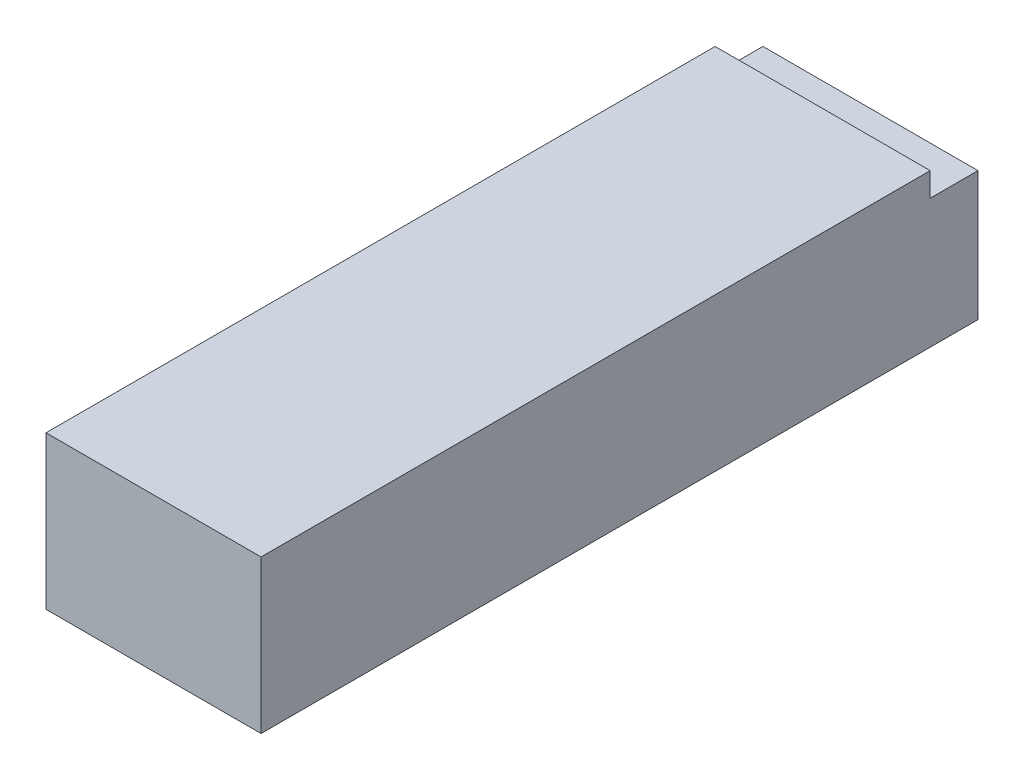
ISO-10303-21;
HEADER;
FILE_DESCRIPTION(('STEP AP214'),'2;1');
FILE_NAME('part.step','',(''),(''),'','','');
FILE_SCHEMA(('AUTOMOTIVE_DESIGN { 1 0 10303 214 1 1 1 1 }'));
ENDSEC;
DATA;
#1=APPLICATION_CONTEXT('core data for automotive mechanical design processes');
#2=APPLICATION_PROTOCOL_DEFINITION('international standard','automotive_design',2000,#1);
#3=PRODUCT_CONTEXT('',#1,'mechanical');
#4=PRODUCT('Part','Part','',(#3));
#5=PRODUCT_RELATED_PRODUCT_CATEGORY('part','',(#4));
#6=PRODUCT_DEFINITION_FORMATION('','',#4);
#7=PRODUCT_DEFINITION_CONTEXT('part definition',#1,'design');
#8=PRODUCT_DEFINITION('design','',#6,#7);
#9=PRODUCT_DEFINITION_SHAPE('','',#8);
#10=(LENGTH_UNIT() NAMED_UNIT(*) SI_UNIT(.MILLI.,.METRE.));
#11=(NAMED_UNIT(*) PLANE_ANGLE_UNIT() SI_UNIT($,.RADIAN.));
#12=(NAMED_UNIT(*) SI_UNIT($,.STERADIAN.) SOLID_ANGLE_UNIT());
#13=UNCERTAINTY_MEASURE_WITH_UNIT(LENGTH_MEASURE(1.E-05),#10,'distance_accuracy_value','');
#14=(GEOMETRIC_REPRESENTATION_CONTEXT(3) GLOBAL_UNCERTAINTY_ASSIGNED_CONTEXT((#13)) GLOBAL_UNIT_ASSIGNED_CONTEXT((#10,
#11,#12)) REPRESENTATION_CONTEXT('',''));
#15=CARTESIAN_POINT('',(0.,0.,0.));
#16=DIRECTION('',(0.,0.,1.));
#17=DIRECTION('',(1.,0.,0.));
#18=AXIS2_PLACEMENT_3D('',#15,#16,#17);
#19=CARTESIAN_POINT('',(22.5,16.,150.));
#20=DIRECTION('',(-1.,0.,0.));
#21=DIRECTION('',(0.,-1.,0.));
#22=AXIS2_PLACEMENT_3D('',#19,#20,#21);
#23=PLANE('',#22);
#24=DIRECTION('',(0.,0.,-1.));
#25=VECTOR('',#24,1.);
#26=CARTESIAN_POINT('',(22.5,11.,10.));
#27=LINE('',#26,#25);
#28=CARTESIAN_POINT('',(22.5,11.,10.));
#29=VERTEX_POINT('',#28);
#30=CARTESIAN_POINT('',(22.5,11.,0.));
#31=VERTEX_POINT('',#30);
#32=EDGE_CURVE('E57',#29,#31,#27,.T.);
#33=ORIENTED_EDGE('',*,*,#32,.F.);
#34=DIRECTION('',(0.,1.,0.));
#35=VECTOR('',#34,1.);
#36=CARTESIAN_POINT('',(22.5,11.,10.));
#37=LINE('',#36,#35);
#38=CARTESIAN_POINT('',(22.5,16.,10.));
#39=VERTEX_POINT('',#38);
#40=EDGE_CURVE('E126',#29,#39,#37,.T.);
#41=ORIENTED_EDGE('',*,*,#40,.T.);
#42=DIRECTION('',(0.,0.,-1.));
#43=VECTOR('',#42,1.);
#44=CARTESIAN_POINT('',(22.5,16.,150.));
#45=LINE('',#44,#43);
#46=CARTESIAN_POINT('',(22.5,16.,150.));
#47=VERTEX_POINT('',#46);
#48=EDGE_CURVE('E11',#47,#39,#45,.T.);
#49=ORIENTED_EDGE('',*,*,#48,.F.);
#50=DIRECTION('',(0.,1.,0.));
#51=VECTOR('',#50,1.);
#52=CARTESIAN_POINT('',(22.5,16.,150.));
#53=LINE('',#52,#51);
#54=CARTESIAN_POINT('',(22.5,-16.,150.));
#55=VERTEX_POINT('',#54);
#56=EDGE_CURVE('E124',#55,#47,#53,.T.);
#57=ORIENTED_EDGE('',*,*,#56,.F.);
#58=DIRECTION('',(0.,0.,-1.));
#59=VECTOR('',#58,1.);
#60=CARTESIAN_POINT('',(22.5,-16.,150.));
#61=LINE('',#60,#59);
#62=CARTESIAN_POINT('',(22.5,-16.,0.));
#63=VERTEX_POINT('',#62);
#64=EDGE_CURVE('E130',#55,#63,#61,.T.);
#65=ORIENTED_EDGE('',*,*,#64,.T.);
#66=DIRECTION('',(0.,1.,0.));
#67=VECTOR('',#66,1.);
#68=CARTESIAN_POINT('',(22.5,16.,0.));
#69=LINE('',#68,#67);
#70=EDGE_CURVE('E122',#63,#31,#69,.T.);
#71=ORIENTED_EDGE('',*,*,#70,.T.);
#72=EDGE_LOOP('',(#33,#41,#49,#57,#65,#71));
#73=FACE_BOUND('',#72,.T.);
#74=ADVANCED_FACE('F43',(#73),#23,.F.);
#75=CARTESIAN_POINT('',(-22.5,16.,150.));
#76=DIRECTION('',(0.,-1.,0.));
#77=DIRECTION('',(0.,0.,-1.));
#78=AXIS2_PLACEMENT_3D('',#75,#76,#77);
#79=PLANE('',#78);
#80=ORIENTED_EDGE('',*,*,#48,.T.);
#81=DIRECTION('',(1.,0.,0.));
#82=VECTOR('',#81,1.);
#83=CARTESIAN_POINT('',(-22.5,16.,10.));
#84=LINE('',#83,#82);
#85=CARTESIAN_POINT('',(-22.5,16.,10.));
#86=VERTEX_POINT('',#85);
#87=EDGE_CURVE('E137',#86,#39,#84,.T.);
#88=ORIENTED_EDGE('',*,*,#87,.F.);
#89=DIRECTION('',(0.,0.,-1.));
#90=VECTOR('',#89,1.);
#91=CARTESIAN_POINT('',(-22.5,16.,150.));
#92=LINE('',#91,#90);
#93=CARTESIAN_POINT('',(-22.5,16.,150.));
#94=VERTEX_POINT('',#93);
#95=EDGE_CURVE('E50',#94,#86,#92,.T.);
#96=ORIENTED_EDGE('',*,*,#95,.F.);
#97=DIRECTION('',(-1.,0.,0.));
#98=VECTOR('',#97,1.);
#99=CARTESIAN_POINT('',(-22.5,16.,150.));
#100=LINE('',#99,#98);
#101=EDGE_CURVE('E88',#47,#94,#100,.T.);
#102=ORIENTED_EDGE('',*,*,#101,.F.);
#103=EDGE_LOOP('',(#80,#88,#96,#102));
#104=FACE_BOUND('',#103,.T.);
#105=ADVANCED_FACE('F136',(#104),#79,.F.);
#106=CARTESIAN_POINT('',(-22.5,16.,150.));
#107=DIRECTION('',(1.,0.,0.));
#108=DIRECTION('',(0.,1.,0.));
#109=AXIS2_PLACEMENT_3D('',#106,#107,#108);
#110=PLANE('',#109);
#111=ORIENTED_EDGE('',*,*,#95,.T.);
#112=DIRECTION('',(0.,1.,0.));
#113=VECTOR('',#112,1.);
#114=CARTESIAN_POINT('',(-22.5,11.,10.));
#115=LINE('',#114,#113);
#116=CARTESIAN_POINT('',(-22.5,11.,10.));
#117=VERTEX_POINT('',#116);
#118=EDGE_CURVE('E118',#117,#86,#115,.T.);
#119=ORIENTED_EDGE('',*,*,#118,.F.);
#120=DIRECTION('',(0.,0.,1.));
#121=VECTOR('',#120,1.);
#122=CARTESIAN_POINT('',(-22.5,11.,10.));
#123=LINE('',#122,#121);
#124=CARTESIAN_POINT('',(-22.5,11.,0.));
#125=VERTEX_POINT('',#124);
#126=EDGE_CURVE('E105',#125,#117,#123,.T.);
#127=ORIENTED_EDGE('',*,*,#126,.F.);
#128=DIRECTION('',(0.,-1.,0.));
#129=VECTOR('',#128,1.);
#130=CARTESIAN_POINT('',(-22.5,16.,0.));
#131=LINE('',#130,#129);
#132=CARTESIAN_POINT('',(-22.5,-16.,0.));
#133=VERTEX_POINT('',#132);
#134=EDGE_CURVE('E117',#125,#133,#131,.T.);
#135=ORIENTED_EDGE('',*,*,#134,.T.);
#136=DIRECTION('',(0.,0.,-1.));
#137=VECTOR('',#136,1.);
#138=CARTESIAN_POINT('',(-22.5,-16.,150.));
#139=LINE('',#138,#137);
#140=CARTESIAN_POINT('',(-22.5,-16.,150.));
#141=VERTEX_POINT('',#140);
#142=EDGE_CURVE('E132',#141,#133,#139,.T.);
#143=ORIENTED_EDGE('',*,*,#142,.F.);
#144=DIRECTION('',(0.,-1.,0.));
#145=VECTOR('',#144,1.);
#146=CARTESIAN_POINT('',(-22.5,16.,150.));
#147=LINE('',#146,#145);
#148=EDGE_CURVE('E134',#94,#141,#147,.T.);
#149=ORIENTED_EDGE('',*,*,#148,.F.);
#150=EDGE_LOOP('',(#111,#119,#127,#135,#143,#149));
#151=FACE_BOUND('',#150,.T.);
#152=ADVANCED_FACE('F115',(#151),#110,.F.);
#153=CARTESIAN_POINT('',(-22.5,-16.,150.));
#154=DIRECTION('',(0.,1.,0.));
#155=DIRECTION('',(0.,0.,1.));
#156=AXIS2_PLACEMENT_3D('',#153,#154,#155);
#157=PLANE('',#156);
#158=DIRECTION('',(1.,0.,0.));
#159=VECTOR('',#158,1.);
#160=CARTESIAN_POINT('',(-22.5,-16.,0.));
#161=LINE('',#160,#159);
#162=EDGE_CURVE('E81',#133,#63,#161,.T.);
#163=ORIENTED_EDGE('',*,*,#162,.T.);
#164=ORIENTED_EDGE('',*,*,#64,.F.);
#165=DIRECTION('',(1.,0.,0.));
#166=VECTOR('',#165,1.);
#167=CARTESIAN_POINT('',(-22.5,-16.,150.));
#168=LINE('',#167,#166);
#169=EDGE_CURVE('E66',#141,#55,#168,.T.);
#170=ORIENTED_EDGE('',*,*,#169,.F.);
#171=ORIENTED_EDGE('',*,*,#142,.T.);
#172=EDGE_LOOP('',(#163,#164,#170,#171));
#173=FACE_BOUND('',#172,.T.);
#174=ADVANCED_FACE('F150',(#173),#157,.F.);
#175=CARTESIAN_POINT('',(0.,0.,150.));
#176=DIRECTION('',(0.,0.,1.));
#177=DIRECTION('',(1.,0.,0.));
#178=AXIS2_PLACEMENT_3D('',#175,#176,#177);
#179=PLANE('',#178);
#180=ORIENTED_EDGE('',*,*,#56,.T.);
#181=ORIENTED_EDGE('',*,*,#101,.T.);
#182=ORIENTED_EDGE('',*,*,#148,.T.);
#183=ORIENTED_EDGE('',*,*,#169,.T.);
#184=EDGE_LOOP('',(#180,#181,#182,#183));
#185=FACE_BOUND('',#184,.T.);
#186=ADVANCED_FACE('F149',(#185),#179,.T.);
#187=CARTESIAN_POINT('',(0.,0.,0.));
#188=DIRECTION('',(0.,0.,1.));
#189=DIRECTION('',(1.,0.,0.));
#190=AXIS2_PLACEMENT_3D('',#187,#188,#189);
#191=PLANE('',#190);
#192=ORIENTED_EDGE('',*,*,#134,.F.);
#193=DIRECTION('',(-1.,0.,0.));
#194=VECTOR('',#193,1.);
#195=CARTESIAN_POINT('',(-22.5,11.,0.));
#196=LINE('',#195,#194);
#197=EDGE_CURVE('E102',#31,#125,#196,.T.);
#198=ORIENTED_EDGE('',*,*,#197,.F.);
#199=ORIENTED_EDGE('',*,*,#70,.F.);
#200=ORIENTED_EDGE('',*,*,#162,.F.);
#201=EDGE_LOOP('',(#192,#198,#199,#200));
#202=FACE_BOUND('',#201,.T.);
#203=ADVANCED_FACE('F121',(#202),#191,.F.);
#204=CARTESIAN_POINT('',(-22.5,11.,10.));
#205=DIRECTION('',(0.,0.,1.));
#206=DIRECTION('',(1.,0.,0.));
#207=AXIS2_PLACEMENT_3D('',#204,#205,#206);
#208=PLANE('',#207);
#209=ORIENTED_EDGE('',*,*,#87,.T.);
#210=ORIENTED_EDGE('',*,*,#40,.F.);
#211=DIRECTION('',(1.,0.,0.));
#212=VECTOR('',#211,1.);
#213=CARTESIAN_POINT('',(-22.5,11.,10.));
#214=LINE('',#213,#212);
#215=EDGE_CURVE('E119',#117,#29,#214,.T.);
#216=ORIENTED_EDGE('',*,*,#215,.F.);
#217=ORIENTED_EDGE('',*,*,#118,.T.);
#218=EDGE_LOOP('',(#209,#210,#216,#217));
#219=FACE_BOUND('',#218,.T.);
#220=ADVANCED_FACE('F153',(#219),#208,.F.);
#221=CARTESIAN_POINT('',(0.,11.,0.));
#222=DIRECTION('',(0.,-1.,0.));
#223=DIRECTION('',(0.,0.,-1.));
#224=AXIS2_PLACEMENT_3D('',#221,#222,#223);
#225=PLANE('',#224);
#226=ORIENTED_EDGE('',*,*,#32,.T.);
#227=ORIENTED_EDGE('',*,*,#197,.T.);
#228=ORIENTED_EDGE('',*,*,#126,.T.);
#229=ORIENTED_EDGE('',*,*,#215,.T.);
#230=EDGE_LOOP('',(#226,#227,#228,#229));
#231=FACE_BOUND('',#230,.T.);
#232=ADVANCED_FACE('F104',(#231),#225,.F.);
#233=CLOSED_SHELL('',(#74,#105,#152,#174,#186,#203,#220,#232));
#234=MANIFOLD_SOLID_BREP('B2',#233);
#235=ADVANCED_BREP_SHAPE_REPRESENTATION('',(#18,#234),#14);
#236=SHAPE_DEFINITION_REPRESENTATION(#9,#235);
ENDSEC;
END-ISO-10303-21;
